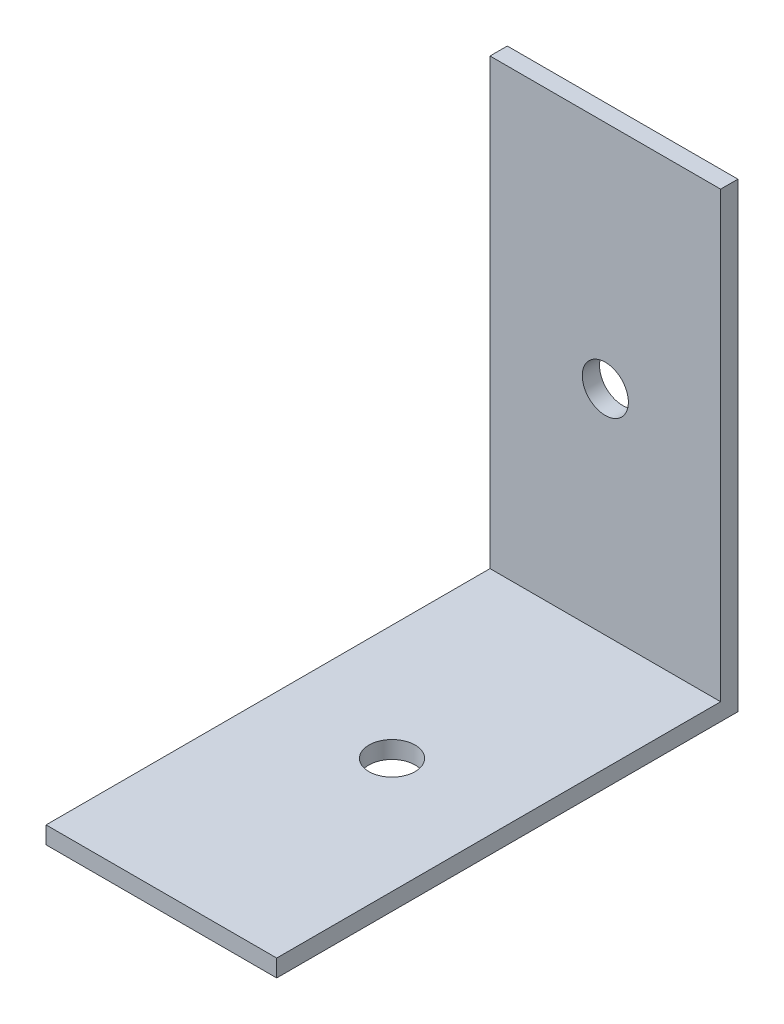
ISO-10303-21;
HEADER;
FILE_DESCRIPTION(('STEP AP214'),'2;1');
FILE_NAME('part.step','',(''),(''),'','','');
FILE_SCHEMA(('AUTOMOTIVE_DESIGN { 1 0 10303 214 1 1 1 1 }'));
ENDSEC;
DATA;
#1=APPLICATION_CONTEXT('core data for automotive mechanical design processes');
#2=APPLICATION_PROTOCOL_DEFINITION('international standard','automotive_design',2000,#1);
#3=PRODUCT_CONTEXT('',#1,'mechanical');
#4=PRODUCT('Part','Part','',(#3));
#5=PRODUCT_RELATED_PRODUCT_CATEGORY('part','',(#4));
#6=PRODUCT_DEFINITION_FORMATION('','',#4);
#7=PRODUCT_DEFINITION_CONTEXT('part definition',#1,'design');
#8=PRODUCT_DEFINITION('design','',#6,#7);
#9=PRODUCT_DEFINITION_SHAPE('','',#8);
#10=(LENGTH_UNIT() NAMED_UNIT(*) SI_UNIT(.MILLI.,.METRE.));
#11=(NAMED_UNIT(*) PLANE_ANGLE_UNIT() SI_UNIT($,.RADIAN.));
#12=(NAMED_UNIT(*) SI_UNIT($,.STERADIAN.) SOLID_ANGLE_UNIT());
#13=UNCERTAINTY_MEASURE_WITH_UNIT(LENGTH_MEASURE(1.E-05),#10,'distance_accuracy_value','');
#14=(GEOMETRIC_REPRESENTATION_CONTEXT(3) GLOBAL_UNCERTAINTY_ASSIGNED_CONTEXT((#13)) GLOBAL_UNIT_ASSIGNED_CONTEXT((#10,
#11,#12)) REPRESENTATION_CONTEXT('',''));
#15=CARTESIAN_POINT('',(0.,0.,0.));
#16=DIRECTION('',(0.,0.,1.));
#17=DIRECTION('',(1.,0.,0.));
#18=AXIS2_PLACEMENT_3D('',#15,#16,#17);
#19=CARTESIAN_POINT('',(0.,1.5,0.));
#20=DIRECTION('',(0.,1.,0.));
#21=DIRECTION('',(0.,0.,1.));
#22=AXIS2_PLACEMENT_3D('',#19,#20,#21);
#23=PLANE('',#22);
#24=DIRECTION('',(1.,0.,0.));
#25=VECTOR('',#24,1.);
#26=CARTESIAN_POINT('',(-10.,1.5,-18.5));
#27=LINE('',#26,#25);
#28=CARTESIAN_POINT('',(-10.,1.5,-18.5));
#29=VERTEX_POINT('',#28);
#30=CARTESIAN_POINT('',(10.,1.5,-18.5));
#31=VERTEX_POINT('',#30);
#32=EDGE_CURVE('E55',#29,#31,#27,.T.);
#33=ORIENTED_EDGE('',*,*,#32,.F.);
#34=DIRECTION('',(0.,0.,1.));
#35=VECTOR('',#34,1.);
#36=CARTESIAN_POINT('',(-10.,1.5,-20.));
#37=LINE('',#36,#35);
#38=CARTESIAN_POINT('',(-10.,1.5,20.));
#39=VERTEX_POINT('',#38);
#40=EDGE_CURVE('E174',#29,#39,#37,.T.);
#41=ORIENTED_EDGE('',*,*,#40,.T.);
#42=DIRECTION('',(1.,0.,0.));
#43=VECTOR('',#42,1.);
#44=CARTESIAN_POINT('',(-10.,1.5,20.));
#45=LINE('',#44,#43);
#46=CARTESIAN_POINT('',(10.,1.5,20.));
#47=VERTEX_POINT('',#46);
#48=EDGE_CURVE('E61',#39,#47,#45,.T.);
#49=ORIENTED_EDGE('',*,*,#48,.T.);
#50=DIRECTION('',(0.,0.,-1.));
#51=VECTOR('',#50,1.);
#52=CARTESIAN_POINT('',(10.,1.5,-20.));
#53=LINE('',#52,#51);
#54=EDGE_CURVE('E91',#47,#31,#53,.T.);
#55=ORIENTED_EDGE('',*,*,#54,.T.);
#56=EDGE_LOOP('',(#33,#41,#49,#55));
#57=FACE_BOUND('',#56,.T.);
#58=CARTESIAN_POINT('',(0.,1.5,0.));
#59=DIRECTION('',(0.,1.,0.));
#60=DIRECTION('',(0.,0.,1.));
#61=AXIS2_PLACEMENT_3D('',#58,#59,#60);
#62=CIRCLE('',#61,2.);
#63=CARTESIAN_POINT('',(0.,1.5,2.));
#64=VERTEX_POINT('',#63);
#65=EDGE_CURVE('E105',#64,#64,#62,.T.);
#66=ORIENTED_EDGE('',*,*,#65,.F.);
#67=EDGE_LOOP('',(#66));
#68=FACE_BOUND('',#67,.T.);
#69=ADVANCED_FACE('F39',(#57,#68),#23,.T.);
#70=CARTESIAN_POINT('',(0.,0.,0.));
#71=DIRECTION('',(0.,1.,0.));
#72=DIRECTION('',(0.,0.,1.));
#73=AXIS2_PLACEMENT_3D('',#70,#71,#72);
#74=PLANE('',#73);
#75=DIRECTION('',(0.,0.,-1.));
#76=VECTOR('',#75,1.);
#77=CARTESIAN_POINT('',(10.,0.,-20.));
#78=LINE('',#77,#76);
#79=CARTESIAN_POINT('',(10.,0.,20.));
#80=VERTEX_POINT('',#79);
#81=CARTESIAN_POINT('',(10.,0.,-20.));
#82=VERTEX_POINT('',#81);
#83=EDGE_CURVE('E97',#80,#82,#78,.T.);
#84=ORIENTED_EDGE('',*,*,#83,.F.);
#85=DIRECTION('',(1.,0.,0.));
#86=VECTOR('',#85,1.);
#87=CARTESIAN_POINT('',(-10.,0.,20.));
#88=LINE('',#87,#86);
#89=CARTESIAN_POINT('',(-10.,0.,20.));
#90=VERTEX_POINT('',#89);
#91=EDGE_CURVE('E80',#90,#80,#88,.T.);
#92=ORIENTED_EDGE('',*,*,#91,.F.);
#93=DIRECTION('',(0.,0.,1.));
#94=VECTOR('',#93,1.);
#95=CARTESIAN_POINT('',(-10.,0.,-20.));
#96=LINE('',#95,#94);
#97=CARTESIAN_POINT('',(-10.,0.,-20.));
#98=VERTEX_POINT('',#97);
#99=EDGE_CURVE('E92',#98,#90,#96,.T.);
#100=ORIENTED_EDGE('',*,*,#99,.F.);
#101=DIRECTION('',(-1.,0.,0.));
#102=VECTOR('',#101,1.);
#103=CARTESIAN_POINT('',(-10.,0.,-20.));
#104=LINE('',#103,#102);
#105=EDGE_CURVE('E103',#82,#98,#104,.T.);
#106=ORIENTED_EDGE('',*,*,#105,.F.);
#107=EDGE_LOOP('',(#84,#92,#100,#106));
#108=FACE_BOUND('',#107,.T.);
#109=CARTESIAN_POINT('',(0.,0.,0.));
#110=DIRECTION('',(0.,1.,0.));
#111=DIRECTION('',(0.,0.,1.));
#112=AXIS2_PLACEMENT_3D('',#109,#110,#111);
#113=CIRCLE('',#112,2.);
#114=CARTESIAN_POINT('',(0.,0.,2.));
#115=VERTEX_POINT('',#114);
#116=EDGE_CURVE('E111',#115,#115,#113,.T.);
#117=ORIENTED_EDGE('',*,*,#116,.T.);
#118=EDGE_LOOP('',(#117));
#119=FACE_BOUND('',#118,.T.);
#120=ADVANCED_FACE('F101',(#108,#119),#74,.F.);
#121=CARTESIAN_POINT('',(10.,1.5,-20.));
#122=DIRECTION('',(-1.,0.,0.));
#123=DIRECTION('',(0.,0.,1.));
#124=AXIS2_PLACEMENT_3D('',#121,#122,#123);
#125=PLANE('',#124);
#126=ORIENTED_EDGE('',*,*,#83,.T.);
#127=DIRECTION('',(0.,-1.,0.));
#128=VECTOR('',#127,1.);
#129=CARTESIAN_POINT('',(10.,1.5,-20.));
#130=LINE('',#129,#128);
#131=CARTESIAN_POINT('',(10.,40.,-20.));
#132=VERTEX_POINT('',#131);
#133=EDGE_CURVE('E11',#132,#82,#130,.T.);
#134=ORIENTED_EDGE('',*,*,#133,.F.);
#135=DIRECTION('',(0.,0.,1.));
#136=VECTOR('',#135,1.);
#137=CARTESIAN_POINT('',(10.,40.,-20.));
#138=LINE('',#137,#136);
#139=CARTESIAN_POINT('',(10.,40.,-18.5));
#140=VERTEX_POINT('',#139);
#141=EDGE_CURVE('E151',#132,#140,#138,.T.);
#142=ORIENTED_EDGE('',*,*,#141,.T.);
#143=DIRECTION('',(0.,-1.,0.));
#144=VECTOR('',#143,1.);
#145=CARTESIAN_POINT('',(10.,40.,-18.5));
#146=LINE('',#145,#144);
#147=EDGE_CURVE('E154',#140,#31,#146,.T.);
#148=ORIENTED_EDGE('',*,*,#147,.T.);
#149=ORIENTED_EDGE('',*,*,#54,.F.);
#150=DIRECTION('',(0.,-1.,0.));
#151=VECTOR('',#150,1.);
#152=CARTESIAN_POINT('',(10.,1.5,20.));
#153=LINE('',#152,#151);
#154=EDGE_CURVE('E83',#47,#80,#153,.T.);
#155=ORIENTED_EDGE('',*,*,#154,.T.);
#156=EDGE_LOOP('',(#126,#134,#142,#148,#149,#155));
#157=FACE_BOUND('',#156,.T.);
#158=ADVANCED_FACE('F41',(#157),#125,.F.);
#159=CARTESIAN_POINT('',(-10.,1.5,-20.));
#160=DIRECTION('',(0.,0.,1.));
#161=DIRECTION('',(1.,0.,0.));
#162=AXIS2_PLACEMENT_3D('',#159,#160,#161);
#163=PLANE('',#162);
#164=CARTESIAN_POINT('',(0.,20.,-20.));
#165=DIRECTION('',(0.,0.,-1.));
#166=DIRECTION('',(-1.,0.,0.));
#167=AXIS2_PLACEMENT_3D('',#164,#165,#166);
#168=CIRCLE('',#167,2.);
#169=CARTESIAN_POINT('',(-2.,20.,-20.));
#170=VERTEX_POINT('',#169);
#171=EDGE_CURVE('E202',#170,#170,#168,.T.);
#172=ORIENTED_EDGE('',*,*,#171,.F.);
#173=EDGE_LOOP('',(#172));
#174=FACE_BOUND('',#173,.T.);
#175=ORIENTED_EDGE('',*,*,#105,.T.);
#176=DIRECTION('',(0.,-1.,0.));
#177=VECTOR('',#176,1.);
#178=CARTESIAN_POINT('',(-10.,1.5,-20.));
#179=LINE('',#178,#177);
#180=CARTESIAN_POINT('',(-10.,40.,-20.));
#181=VERTEX_POINT('',#180);
#182=EDGE_CURVE('E48',#181,#98,#179,.T.);
#183=ORIENTED_EDGE('',*,*,#182,.F.);
#184=DIRECTION('',(1.,0.,0.));
#185=VECTOR('',#184,1.);
#186=CARTESIAN_POINT('',(-10.,40.,-20.));
#187=LINE('',#186,#185);
#188=EDGE_CURVE('E133',#181,#132,#187,.T.);
#189=ORIENTED_EDGE('',*,*,#188,.T.);
#190=ORIENTED_EDGE('',*,*,#133,.T.);
#191=EDGE_LOOP('',(#175,#183,#189,#190));
#192=FACE_BOUND('',#191,.T.);
#193=ADVANCED_FACE('F131',(#174,#192),#163,.F.);
#194=CARTESIAN_POINT('',(-10.,1.5,-20.));
#195=DIRECTION('',(1.,0.,0.));
#196=DIRECTION('',(0.,0.,-1.));
#197=AXIS2_PLACEMENT_3D('',#194,#195,#196);
#198=PLANE('',#197);
#199=ORIENTED_EDGE('',*,*,#99,.T.);
#200=DIRECTION('',(0.,-1.,0.));
#201=VECTOR('',#200,1.);
#202=CARTESIAN_POINT('',(-10.,1.5,20.));
#203=LINE('',#202,#201);
#204=EDGE_CURVE('E86',#39,#90,#203,.T.);
#205=ORIENTED_EDGE('',*,*,#204,.F.);
#206=ORIENTED_EDGE('',*,*,#40,.F.);
#207=DIRECTION('',(0.,-1.,0.));
#208=VECTOR('',#207,1.);
#209=CARTESIAN_POINT('',(-10.,40.,-18.5));
#210=LINE('',#209,#208);
#211=CARTESIAN_POINT('',(-10.,40.,-18.5));
#212=VERTEX_POINT('',#211);
#213=EDGE_CURVE('E157',#212,#29,#210,.T.);
#214=ORIENTED_EDGE('',*,*,#213,.F.);
#215=DIRECTION('',(0.,0.,1.));
#216=VECTOR('',#215,1.);
#217=CARTESIAN_POINT('',(-10.,40.,-20.));
#218=LINE('',#217,#216);
#219=EDGE_CURVE('E127',#181,#212,#218,.T.);
#220=ORIENTED_EDGE('',*,*,#219,.F.);
#221=ORIENTED_EDGE('',*,*,#182,.T.);
#222=EDGE_LOOP('',(#199,#205,#206,#214,#220,#221));
#223=FACE_BOUND('',#222,.T.);
#224=ADVANCED_FACE('F124',(#223),#198,.F.);
#225=CARTESIAN_POINT('',(-10.,1.5,20.));
#226=DIRECTION('',(0.,0.,-1.));
#227=DIRECTION('',(-1.,0.,0.));
#228=AXIS2_PLACEMENT_3D('',#225,#226,#227);
#229=PLANE('',#228);
#230=ORIENTED_EDGE('',*,*,#91,.T.);
#231=ORIENTED_EDGE('',*,*,#154,.F.);
#232=ORIENTED_EDGE('',*,*,#48,.F.);
#233=ORIENTED_EDGE('',*,*,#204,.T.);
#234=EDGE_LOOP('',(#230,#231,#232,#233));
#235=FACE_BOUND('',#234,.T.);
#236=ADVANCED_FACE('F82',(#235),#229,.F.);
#237=CARTESIAN_POINT('',(0.,1.5,0.));
#238=DIRECTION('',(0.,-1.,0.));
#239=DIRECTION('',(0.,0.,-1.));
#240=AXIS2_PLACEMENT_3D('',#237,#238,#239);
#241=CYLINDRICAL_SURFACE('',#240,2.);
#242=ORIENTED_EDGE('',*,*,#65,.T.);
#243=EDGE_LOOP('',(#242));
#244=FACE_BOUND('',#243,.T.);
#245=ORIENTED_EDGE('',*,*,#116,.F.);
#246=EDGE_LOOP('',(#245));
#247=FACE_BOUND('',#246,.T.);
#248=ADVANCED_FACE('F182',(#244,#247),#241,.F.);
#249=CARTESIAN_POINT('',(-10.,40.,-18.5));
#250=DIRECTION('',(0.,0.,-1.));
#251=DIRECTION('',(-1.,0.,0.));
#252=AXIS2_PLACEMENT_3D('',#249,#250,#251);
#253=PLANE('',#252);
#254=CARTESIAN_POINT('',(0.,20.,-18.5));
#255=DIRECTION('',(0.,0.,-1.));
#256=DIRECTION('',(-1.,0.,0.));
#257=AXIS2_PLACEMENT_3D('',#254,#255,#256);
#258=CIRCLE('',#257,2.);
#259=CARTESIAN_POINT('',(-2.,20.,-18.5));
#260=VERTEX_POINT('',#259);
#261=EDGE_CURVE('E166',#260,#260,#258,.F.);
#262=ORIENTED_EDGE('',*,*,#261,.F.);
#263=EDGE_LOOP('',(#262));
#264=FACE_BOUND('',#263,.T.);
#265=ORIENTED_EDGE('',*,*,#32,.T.);
#266=ORIENTED_EDGE('',*,*,#147,.F.);
#267=DIRECTION('',(1.,0.,0.));
#268=VECTOR('',#267,1.);
#269=CARTESIAN_POINT('',(-10.,40.,-18.5));
#270=LINE('',#269,#268);
#271=EDGE_CURVE('E146',#212,#140,#270,.T.);
#272=ORIENTED_EDGE('',*,*,#271,.F.);
#273=ORIENTED_EDGE('',*,*,#213,.T.);
#274=EDGE_LOOP('',(#265,#266,#272,#273));
#275=FACE_BOUND('',#274,.T.);
#276=ADVANCED_FACE('F155',(#264,#275),#253,.F.);
#277=CARTESIAN_POINT('',(0.,40.,0.));
#278=DIRECTION('',(0.,1.,0.));
#279=DIRECTION('',(0.,0.,1.));
#280=AXIS2_PLACEMENT_3D('',#277,#278,#279);
#281=PLANE('',#280);
#282=ORIENTED_EDGE('',*,*,#219,.T.);
#283=ORIENTED_EDGE('',*,*,#271,.T.);
#284=ORIENTED_EDGE('',*,*,#141,.F.);
#285=ORIENTED_EDGE('',*,*,#188,.F.);
#286=EDGE_LOOP('',(#282,#283,#284,#285));
#287=FACE_BOUND('',#286,.T.);
#288=ADVANCED_FACE('F149',(#287),#281,.T.);
#289=CARTESIAN_POINT('',(0.,20.,-12.8431457505076));
#290=DIRECTION('',(0.,0.,-1.));
#291=DIRECTION('',(-1.,0.,0.));
#292=AXIS2_PLACEMENT_3D('',#289,#290,#291);
#293=CYLINDRICAL_SURFACE('',#292,2.);
#294=ORIENTED_EDGE('',*,*,#261,.T.);
#295=EDGE_LOOP('',(#294));
#296=FACE_BOUND('',#295,.T.);
#297=ORIENTED_EDGE('',*,*,#171,.T.);
#298=EDGE_LOOP('',(#297));
#299=FACE_BOUND('',#298,.T.);
#300=ADVANCED_FACE('F212',(#296,#299),#293,.F.);
#301=CLOSED_SHELL('',(#69,#120,#158,#193,#224,#236,#248,#276,#288,#300));
#302=MANIFOLD_SOLID_BREP('B2',#301);
#303=ADVANCED_BREP_SHAPE_REPRESENTATION('',(#18,#302),#14);
#304=SHAPE_DEFINITION_REPRESENTATION(#9,#303);
ENDSEC;
END-ISO-10303-21;
